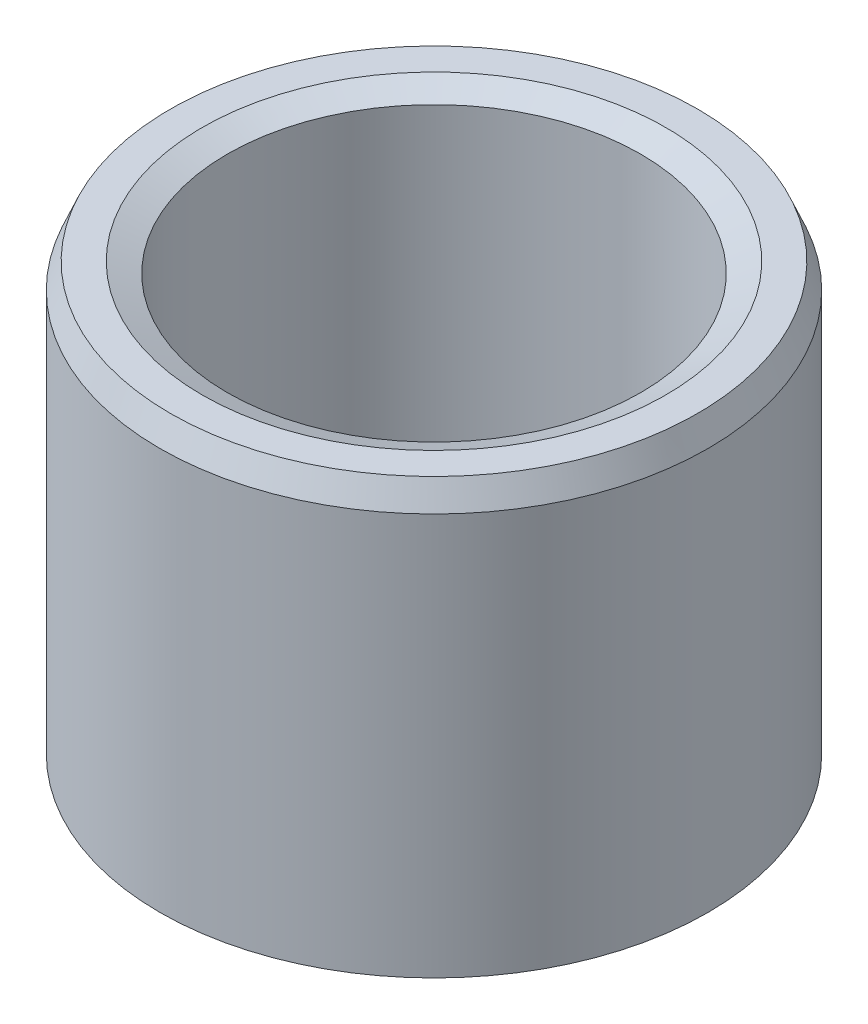
ISO-10303-21;
HEADER;
FILE_DESCRIPTION(('STEP AP214'),'2;1');
FILE_NAME('part.step','',(''),(''),'','','');
FILE_SCHEMA(('AUTOMOTIVE_DESIGN { 1 0 10303 214 1 1 1 1 }'));
ENDSEC;
DATA;
#1=APPLICATION_CONTEXT('core data for automotive mechanical design processes');
#2=APPLICATION_PROTOCOL_DEFINITION('international standard','automotive_design',2000,#1);
#3=PRODUCT_CONTEXT('',#1,'mechanical');
#4=PRODUCT('Part','Part','',(#3));
#5=PRODUCT_RELATED_PRODUCT_CATEGORY('part','',(#4));
#6=PRODUCT_DEFINITION_FORMATION('','',#4);
#7=PRODUCT_DEFINITION_CONTEXT('part definition',#1,'design');
#8=PRODUCT_DEFINITION('design','',#6,#7);
#9=PRODUCT_DEFINITION_SHAPE('','',#8);
#10=(LENGTH_UNIT() NAMED_UNIT(*) SI_UNIT(.MILLI.,.METRE.));
#11=(NAMED_UNIT(*) PLANE_ANGLE_UNIT() SI_UNIT($,.RADIAN.));
#12=(NAMED_UNIT(*) SI_UNIT($,.STERADIAN.) SOLID_ANGLE_UNIT());
#13=UNCERTAINTY_MEASURE_WITH_UNIT(LENGTH_MEASURE(1.E-05),#10,'distance_accuracy_value','');
#14=(GEOMETRIC_REPRESENTATION_CONTEXT(3) GLOBAL_UNCERTAINTY_ASSIGNED_CONTEXT((#13)) GLOBAL_UNIT_ASSIGNED_CONTEXT((#10,
#11,#12)) REPRESENTATION_CONTEXT('',''));
#15=CARTESIAN_POINT('',(0.,0.,0.));
#16=DIRECTION('',(0.,0.,1.));
#17=DIRECTION('',(1.,0.,0.));
#18=AXIS2_PLACEMENT_3D('',#15,#16,#17);
#19=CARTESIAN_POINT('',(0.,23.9303540021509,0.));
#20=DIRECTION('',(0.,-1.,0.));
#21=DIRECTION('',(0.,0.,-1.));
#22=AXIS2_PLACEMENT_3D('',#19,#20,#21);
#23=CYLINDRICAL_SURFACE('',#22,15.);
#24=CARTESIAN_POINT('',(0.,0.574381194216732,0.));
#25=DIRECTION('',(0.,1.,0.));
#26=DIRECTION('',(0.,0.,1.));
#27=AXIS2_PLACEMENT_3D('',#24,#25,#26);
#28=CIRCLE('',#27,15.);
#29=CARTESIAN_POINT('',(0.,0.574381194216732,15.));
#30=VERTEX_POINT('',#29);
#31=EDGE_CURVE('E10',#30,#30,#28,.T.);
#32=ORIENTED_EDGE('',*,*,#31,.T.);
#33=EDGE_LOOP('',(#32));
#34=FACE_BOUND('',#33,.T.);
#35=CARTESIAN_POINT('',(0.,22.5578988810046,0.));
#36=DIRECTION('',(0.,1.,0.));
#37=DIRECTION('',(0.,0.,1.));
#38=AXIS2_PLACEMENT_3D('',#35,#36,#37);
#39=CIRCLE('',#38,15.);
#40=CARTESIAN_POINT('',(0.,22.5578988810046,15.));
#41=VERTEX_POINT('',#40);
#42=EDGE_CURVE('E50',#41,#41,#39,.F.);
#43=ORIENTED_EDGE('',*,*,#42,.T.);
#44=EDGE_LOOP('',(#43));
#45=FACE_BOUND('',#44,.T.);
#46=ADVANCED_FACE('F39',(#34,#45),#23,.T.);
#47=CARTESIAN_POINT('',(0.,23.9303540021509,0.));
#48=DIRECTION('',(0.,1.,0.));
#49=DIRECTION('',(0.,0.,1.));
#50=AXIS2_PLACEMENT_3D('',#47,#48,#49);
#51=PLANE('',#50);
#52=CARTESIAN_POINT('',(0.,23.9303540021509,0.));
#53=DIRECTION('',(0.,1.,0.));
#54=DIRECTION('',(0.,0.,1.));
#55=AXIS2_PLACEMENT_3D('',#52,#53,#54);
#56=CIRCLE('',#55,12.6806159307956);
#57=CARTESIAN_POINT('',(0.,23.9303540021509,12.6806159307956));
#58=VERTEX_POINT('',#57);
#59=EDGE_CURVE('E58',#58,#58,#56,.F.);
#60=ORIENTED_EDGE('',*,*,#59,.T.);
#61=EDGE_LOOP('',(#60));
#62=FACE_BOUND('',#61,.T.);
#63=CARTESIAN_POINT('',(0.,23.9303540021509,0.));
#64=DIRECTION('',(0.,1.,0.));
#65=DIRECTION('',(0.,0.,1.));
#66=AXIS2_PLACEMENT_3D('',#63,#64,#65);
#67=CIRCLE('',#66,14.4256188057833);
#68=CARTESIAN_POINT('',(0.,23.9303540021509,14.4256188057833));
#69=VERTEX_POINT('',#68);
#70=EDGE_CURVE('E61',#69,#69,#67,.T.);
#71=ORIENTED_EDGE('',*,*,#70,.T.);
#72=EDGE_LOOP('',(#71));
#73=FACE_BOUND('',#72,.T.);
#74=ADVANCED_FACE('F88',(#62,#73),#51,.T.);
#75=CARTESIAN_POINT('',(0.,0.,0.));
#76=DIRECTION('',(0.,1.,0.));
#77=DIRECTION('',(0.,0.,1.));
#78=AXIS2_PLACEMENT_3D('',#75,#76,#77);
#79=PLANE('',#78);
#80=CARTESIAN_POINT('',(0.,0.,0.));
#81=DIRECTION('',(0.,1.,0.));
#82=DIRECTION('',(0.,0.,1.));
#83=AXIS2_PLACEMENT_3D('',#80,#81,#82);
#84=CIRCLE('',#83,11.882542003866);
#85=CARTESIAN_POINT('',(0.,0.,11.882542003866));
#86=VERTEX_POINT('',#85);
#87=EDGE_CURVE('E51',#86,#86,#84,.T.);
#88=ORIENTED_EDGE('',*,*,#87,.T.);
#89=EDGE_LOOP('',(#88));
#90=FACE_BOUND('',#89,.T.);
#91=CARTESIAN_POINT('',(0.,0.,0.));
#92=DIRECTION('',(0.,1.,0.));
#93=DIRECTION('',(0.,0.,1.));
#94=AXIS2_PLACEMENT_3D('',#91,#92,#93);
#95=CIRCLE('',#94,13.6275448788537);
#96=CARTESIAN_POINT('',(0.,0.,13.6275448788537));
#97=VERTEX_POINT('',#96);
#98=EDGE_CURVE('E54',#97,#97,#95,.F.);
#99=ORIENTED_EDGE('',*,*,#98,.T.);
#100=EDGE_LOOP('',(#99));
#101=FACE_BOUND('',#100,.T.);
#102=ADVANCED_FACE('F83',(#90,#101),#79,.F.);
#103=CARTESIAN_POINT('',(0.,23.9303540021509,0.));
#104=DIRECTION('',(0.,-1.,0.));
#105=DIRECTION('',(0.,0.,-1.));
#106=AXIS2_PLACEMENT_3D('',#103,#104,#105);
#107=CYLINDRICAL_SURFACE('',#106,11.3081608096493);
#108=CARTESIAN_POINT('',(0.,23.3559728079342,0.));
#109=DIRECTION('',(0.,1.,0.));
#110=DIRECTION('',(0.,0.,1.));
#111=AXIS2_PLACEMENT_3D('',#108,#109,#110);
#112=CIRCLE('',#111,11.3081608096493);
#113=CARTESIAN_POINT('',(0.,23.3559728079342,11.3081608096493));
#114=VERTEX_POINT('',#113);
#115=EDGE_CURVE('E67',#114,#114,#112,.T.);
#116=ORIENTED_EDGE('',*,*,#115,.T.);
#117=EDGE_LOOP('',(#116));
#118=FACE_BOUND('',#117,.T.);
#119=CARTESIAN_POINT('',(0.,1.37245512114631,0.));
#120=DIRECTION('',(0.,1.,0.));
#121=DIRECTION('',(0.,0.,1.));
#122=AXIS2_PLACEMENT_3D('',#119,#120,#121);
#123=CIRCLE('',#122,11.3081608096493);
#124=CARTESIAN_POINT('',(0.,1.37245512114631,11.3081608096493));
#125=VERTEX_POINT('',#124);
#126=EDGE_CURVE('E69',#125,#125,#123,.F.);
#127=ORIENTED_EDGE('',*,*,#126,.T.);
#128=EDGE_LOOP('',(#127));
#129=FACE_BOUND('',#128,.T.);
#130=ADVANCED_FACE('F71',(#118,#129),#107,.F.);
#131=CARTESIAN_POINT('',(0.,23.3559728079342,0.));
#132=DIRECTION('',(0.,1.,0.));
#133=DIRECTION('',(0.,0.,1.));
#134=AXIS2_PLACEMENT_3D('',#131,#132,#133);
#135=CONICAL_SURFACE('',#134,11.3081608096493,1.17443868393162);
#136=ORIENTED_EDGE('',*,*,#59,.F.);
#137=EDGE_LOOP('',(#136));
#138=FACE_BOUND('',#137,.T.);
#139=ORIENTED_EDGE('',*,*,#115,.F.);
#140=EDGE_LOOP('',(#139));
#141=FACE_BOUND('',#140,.T.);
#142=ADVANCED_FACE('F77',(#138,#141),#135,.F.);
#143=CARTESIAN_POINT('',(0.,0.,0.));
#144=DIRECTION('',(0.,-1.,0.));
#145=DIRECTION('',(0.,0.,-1.));
#146=AXIS2_PLACEMENT_3D('',#143,#144,#145);
#147=CONICAL_SURFACE('',#146,11.882542003866,0.396357642863273);
#148=ORIENTED_EDGE('',*,*,#126,.F.);
#149=EDGE_LOOP('',(#148));
#150=FACE_BOUND('',#149,.T.);
#151=ORIENTED_EDGE('',*,*,#87,.F.);
#152=EDGE_LOOP('',(#151));
#153=FACE_BOUND('',#152,.T.);
#154=ADVANCED_FACE('F73',(#150,#153),#147,.F.);
#155=CARTESIAN_POINT('',(0.,0.574381194216732,0.));
#156=DIRECTION('',(0.,1.,0.));
#157=DIRECTION('',(0.,0.,1.));
#158=AXIS2_PLACEMENT_3D('',#155,#156,#157);
#159=CONICAL_SURFACE('',#158,15.,1.17443868393162);
#160=ORIENTED_EDGE('',*,*,#98,.F.);
#161=EDGE_LOOP('',(#160));
#162=FACE_BOUND('',#161,.T.);
#163=ORIENTED_EDGE('',*,*,#31,.F.);
#164=EDGE_LOOP('',(#163));
#165=FACE_BOUND('',#164,.T.);
#166=ADVANCED_FACE('F76',(#162,#165),#159,.T.);
#167=CARTESIAN_POINT('',(0.,23.9303540021509,0.));
#168=DIRECTION('',(0.,-1.,0.));
#169=DIRECTION('',(0.,0.,-1.));
#170=AXIS2_PLACEMENT_3D('',#167,#168,#169);
#171=CONICAL_SURFACE('',#170,14.4256188057833,0.396357642863275);
#172=ORIENTED_EDGE('',*,*,#42,.F.);
#173=EDGE_LOOP('',(#172));
#174=FACE_BOUND('',#173,.T.);
#175=ORIENTED_EDGE('',*,*,#70,.F.);
#176=EDGE_LOOP('',(#175));
#177=FACE_BOUND('',#176,.T.);
#178=ADVANCED_FACE('F45',(#174,#177),#171,.T.);
#179=CLOSED_SHELL('',(#46,#74,#102,#130,#142,#154,#166,#178));
#180=MANIFOLD_SOLID_BREP('B2',#179);
#181=ADVANCED_BREP_SHAPE_REPRESENTATION('',(#18,#180),#14);
#182=SHAPE_DEFINITION_REPRESENTATION(#9,#181);
ENDSEC;
END-ISO-10303-21;
